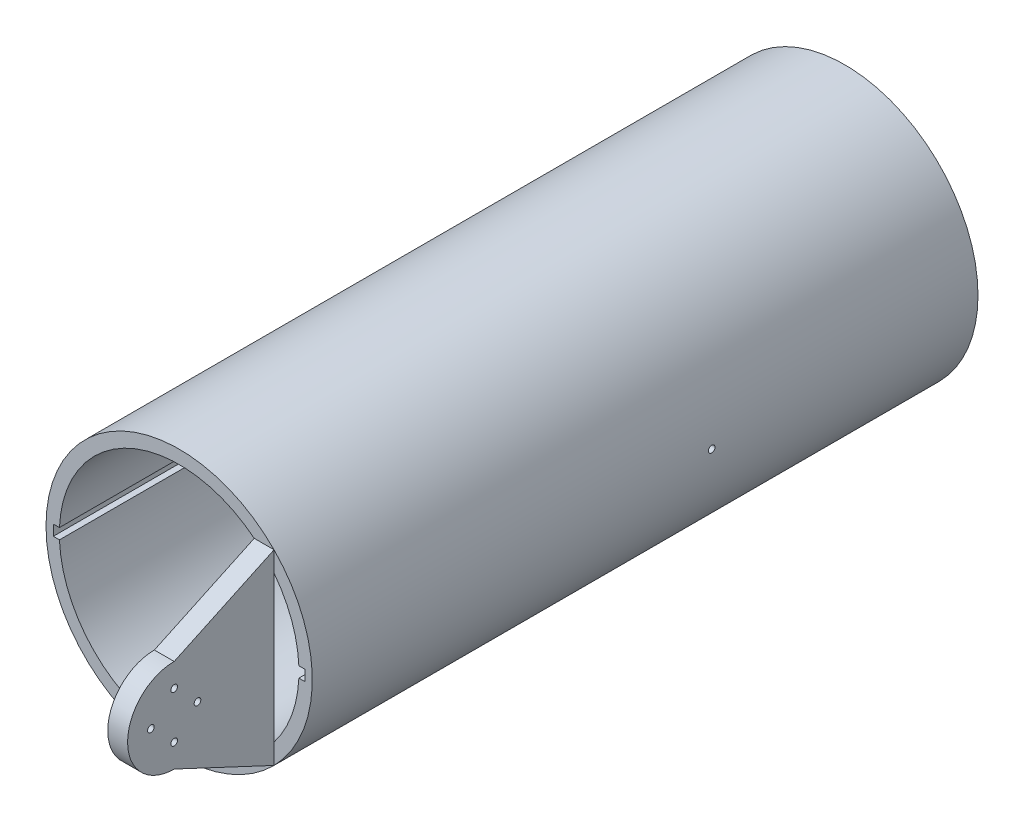
ISO-10303-21;
HEADER;
FILE_DESCRIPTION(('STEP AP214'),'2;1');
FILE_NAME('part.step','',(''),(''),'','','');
FILE_SCHEMA(('AUTOMOTIVE_DESIGN { 1 0 10303 214 1 1 1 1 }'));
ENDSEC;
DATA;
#1=APPLICATION_CONTEXT('core data for automotive mechanical design processes');
#2=APPLICATION_PROTOCOL_DEFINITION('international standard','automotive_design',2000,#1);
#3=PRODUCT_CONTEXT('',#1,'mechanical');
#4=PRODUCT('Part','Part','',(#3));
#5=PRODUCT_RELATED_PRODUCT_CATEGORY('part','',(#4));
#6=PRODUCT_DEFINITION_FORMATION('','',#4);
#7=PRODUCT_DEFINITION_CONTEXT('part definition',#1,'design');
#8=PRODUCT_DEFINITION('design','',#6,#7);
#9=PRODUCT_DEFINITION_SHAPE('','',#8);
#10=(LENGTH_UNIT() NAMED_UNIT(*) SI_UNIT(.MILLI.,.METRE.));
#11=(NAMED_UNIT(*) PLANE_ANGLE_UNIT() SI_UNIT($,.RADIAN.));
#12=(NAMED_UNIT(*) SI_UNIT($,.STERADIAN.) SOLID_ANGLE_UNIT());
#13=UNCERTAINTY_MEASURE_WITH_UNIT(LENGTH_MEASURE(1.E-05),#10,'distance_accuracy_value','');
#14=(GEOMETRIC_REPRESENTATION_CONTEXT(3) GLOBAL_UNCERTAINTY_ASSIGNED_CONTEXT((#13)) GLOBAL_UNIT_ASSIGNED_CONTEXT((#10,
#11,#12)) REPRESENTATION_CONTEXT('',''));
#15=CARTESIAN_POINT('',(0.,0.,0.));
#16=DIRECTION('',(0.,0.,1.));
#17=DIRECTION('',(1.,0.,0.));
#18=AXIS2_PLACEMENT_3D('',#15,#16,#17);
#19=CARTESIAN_POINT('',(0.,0.,250.));
#20=DIRECTION('',(0.,0.,-1.));
#21=DIRECTION('',(-1.,0.,0.));
#22=AXIS2_PLACEMENT_3D('',#19,#20,#21);
#23=CYLINDRICAL_SURFACE('',#22,50.);
#24=CARTESIAN_POINT('',(50.,0.,101.25));
#25=CARTESIAN_POINT('',(49.9999997892433,-0.0702012806053509,101.249996890468));
#26=CARTESIAN_POINT('',(49.9998505669129,-0.140453184521729,101.244066287815));
#27=CARTESIAN_POINT('',(49.9992696347054,-0.279021411192673,101.220490687249));
#28=CARTESIAN_POINT('',(49.9988375866143,-0.347335314234984,101.202831663669));
#29=CARTESIAN_POINT('',(49.9977399359377,-0.480000032970664,101.156302971443));
#30=CARTESIAN_POINT('',(49.9970744467966,-0.544352755839818,101.127438747421));
#31=CARTESIAN_POINT('',(49.9955849996606,-0.66728119145738,101.059326712717));
#32=CARTESIAN_POINT('',(49.9947610805834,-0.725858317628449,101.020081451217));
#33=CARTESIAN_POINT('',(49.9930472282989,-0.835612011829375,100.932304373999));
#34=CARTESIAN_POINT('',(49.9921572753778,-0.886786356266493,100.883769778147));
#35=CARTESIAN_POINT('',(49.9904118342181,-0.980263255157657,100.778796235128));
#36=CARTESIAN_POINT('',(49.9895563473475,-1.02256545779515,100.722356974657));
#37=CARTESIAN_POINT('',(49.9879762331022,-1.09709940400727,100.603169665472));
#38=CARTESIAN_POINT('',(49.9872516204449,-1.12933001528882,100.540420908464));
#39=CARTESIAN_POINT('',(49.9860151168566,-1.1827984149725,100.410400905536));
#40=CARTESIAN_POINT('',(49.9855032252025,-1.20403624074213,100.343129674991));
#41=CARTESIAN_POINT('',(49.9847500083149,-1.23491198038136,100.205989232804));
#42=CARTESIAN_POINT('',(49.9845086262981,-1.24455232873584,100.136120569578));
#43=CARTESIAN_POINT('',(49.9843234739843,-1.25196695086035,99.9957562161149));
#44=CARTESIAN_POINT('',(49.9843797026986,-1.24974126405586,99.925260527962));
#45=CARTESIAN_POINT('',(49.9847833781213,-1.23348907585994,99.7856597612978));
#46=CARTESIAN_POINT('',(49.9851307597476,-1.21946521174131,99.7165543755436));
#47=CARTESIAN_POINT('',(49.9860774771185,-1.18001883030617,99.5816790450587));
#48=CARTESIAN_POINT('',(49.9866768133296,-1.15459629188151,99.5159091065049));
#49=CARTESIAN_POINT('',(49.9880599499198,-1.09307119196166,99.3895631952896));
#50=CARTESIAN_POINT('',(49.988843771187,-1.0569674209775,99.3289878118357));
#51=CARTESIAN_POINT('',(49.9905074926856,-0.975105623991352,99.21475701138));
#52=CARTESIAN_POINT('',(49.9913873930577,-0.929347583862107,99.1611016045044));
#53=CARTESIAN_POINT('',(49.9931443684604,-0.829461225210461,99.0622184655441));
#54=CARTESIAN_POINT('',(49.9940214426512,-0.775330617915762,99.0169930454051));
#55=CARTESIAN_POINT('',(49.9956736570713,-0.660243785237119,98.9362714726598));
#56=CARTESIAN_POINT('',(49.9964487972851,-0.599287558820383,98.9007753215255));
#57=CARTESIAN_POINT('',(49.9978097681651,-0.472278559451485,98.8405201705382));
#58=CARTESIAN_POINT('',(49.9983955975763,-0.406225752717142,98.8157612418629));
#59=CARTESIAN_POINT('',(49.9993118852416,-0.270899185047347,98.7776848280001));
#60=CARTESIAN_POINT('',(49.9996423439818,-0.201625430244547,98.7643673210292));
#61=CARTESIAN_POINT('',(50.0000105760241,-0.0618435041436848,98.7495546188588));
#62=CARTESIAN_POINT('',(50.0000484285156,0.00866432799248807,98.7480562249943));
#63=CARTESIAN_POINT('',(49.999827390649,0.148930569407979,98.7569159498476));
#64=CARTESIAN_POINT('',(49.9995685005257,0.218688979279795,98.7672740591908));
#65=CARTESIAN_POINT('',(49.9987832089567,0.355467259085124,98.7995501119755));
#66=CARTESIAN_POINT('',(49.9982568410845,0.422487471571989,98.8214666046421));
#67=CARTESIAN_POINT('',(49.9969959169746,0.551897387208432,98.876235815335));
#68=CARTESIAN_POINT('',(49.9962613604543,0.614287084075191,98.9090885481995));
#69=CARTESIAN_POINT('',(49.9946666309293,0.732679665489656,98.9848059046364));
#70=CARTESIAN_POINT('',(49.9938064309167,0.788681172235662,99.0276726819793));
#71=CARTESIAN_POINT('',(49.9920574600653,0.892693853571702,99.1221981272366));
#72=CARTESIAN_POINT('',(49.9911686891723,0.940705013006051,99.1738568118267));
#73=CARTESIAN_POINT('',(49.9894625477771,1.02738478773992,99.2845133569773));
#74=CARTESIAN_POINT('',(49.9886451930737,1.06605133914107,99.3435128345125));
#75=CARTESIAN_POINT('',(49.9871742851885,1.13293016503026,99.467167887786));
#76=CARTESIAN_POINT('',(49.9865207316976,1.16114245925612,99.5318234528452));
#77=CARTESIAN_POINT('',(49.9854512245261,1.20630831809067,99.6649475530868));
#78=CARTESIAN_POINT('',(49.9850352425774,1.22326322223585,99.7334156335601));
#79=CARTESIAN_POINT('',(49.9844876991685,1.24543740915402,99.8722276845196));
#80=CARTESIAN_POINT('',(49.9843561376915,1.25065669262368,99.9425716548945));
#81=CARTESIAN_POINT('',(49.9843922787728,1.24921131303956,100.08311792715));
#82=CARTESIAN_POINT('',(49.9845598992096,1.242549911081,100.153320262613));
#83=CARTESIAN_POINT('',(49.985175335134,1.21753894538223,100.291609864828));
#84=CARTESIAN_POINT('',(49.98562315118,1.19918935835732,100.359697127367));
#85=CARTESIAN_POINT('',(49.986748485414,1.15132321438058,100.49182541808));
#86=CARTESIAN_POINT('',(49.9874260076321,1.12180646151248,100.555866375244));
#87=CARTESIAN_POINT('',(49.9889343430816,1.05244537142006,100.678082151641));
#88=CARTESIAN_POINT('',(49.9897651506242,1.01260141744787,100.736257188454));
#89=CARTESIAN_POINT('',(49.9914866049636,0.92370883247783,100.845103812792));
#90=CARTESIAN_POINT('',(49.992377261793,0.874658655736825,100.895774137701));
#91=CARTESIAN_POINT('',(49.994118137793,0.768733478143212,100.988174453478));
#92=CARTESIAN_POINT('',(49.9949683468844,0.711856540554558,101.02990222495));
#93=CARTESIAN_POINT('',(49.9965327264857,0.591873911934435,101.103237927888));
#94=CARTESIAN_POINT('',(49.9972468156398,0.528764529907139,101.134839814985));
#95=CARTESIAN_POINT('',(49.998456932991,0.398183073403346,101.186962967462));
#96=CARTESIAN_POINT('',(49.9989532215103,0.330716318304683,101.207497467673));
#97=CARTESIAN_POINT('',(49.999538941339,0.219018516921423,101.231451616862));
#98=CARTESIAN_POINT('',(49.9997110897919,0.175512722018037,101.238398530281));
#99=CARTESIAN_POINT('',(49.9999416851822,0.0880112516517628,101.247673696205));
#100=CARTESIAN_POINT('',(50.0000001321426,0.0440155762883697,101.250001949649));
#101=CARTESIAN_POINT('',(50.,0.,101.25));
#102=B_SPLINE_CURVE_WITH_KNOTS('',3,(#24,#25,#26,#27,#28,#29,#30,#31,#32,#33,#34,#35,#36,#37,
#38,#39,#40,#41,#42,#43,#44,#45,#46,#47,#48,#49,#50,#51,#52,#53,#54,#55,#56,#57,#58,#59,#60,#61,
#62,#63,#64,#65,#66,#67,#68,#69,#70,#71,#72,#73,#74,#75,#76,#77,#78,#79,#80,#81,#82,#83,#84,#85,
#86,#87,#88,#89,#90,#91,#92,#93,#94,#95,#96,#97,#98,#99,#100,#101),.UNSPECIFIED.,.T.,.F.,(4,2,2,
2,2,2,2,2,2,2,2,2,2,2,2,2,2,2,2,2,2,2,2,2,2,2,2,2,2,2,2,2,2,2,2,2,2,2,4),(0.,0.210443181033347,
0.421138479019948,0.631731527740004,0.842272910862806,1.05287740411288,1.26349024711038,
1.47412675962819,1.68476255612964,1.89535412929105,2.10594500275222,2.31648881487096,
2.52703301687766,2.73760106897999,2.94816942921227,3.15879545366897,3.36942150999579,
3.58004896255672,3.79067601410156,4.00124606064959,4.21181594070732,4.42235939693014,
4.63290313881923,4.84349220516216,5.05408167093516,5.26471760616385,5.47535314370606,
5.68596361286427,5.89657406951998,6.10712672521302,6.3176798003613,6.5282365696147,
6.73878552602708,6.94936986570474,7.16000640860575,7.37076845199211,7.58127789517965,
7.71322391796614,7.84516991395463),.UNSPECIFIED.);
#103=CARTESIAN_POINT('',(50.,0.,101.25));
#104=VERTEX_POINT('',#103);
#105=EDGE_CURVE('E223',#104,#104,#102,.T.);
#106=ORIENTED_EDGE('',*,*,#105,.F.);
#107=EDGE_LOOP('',(#106));
#108=FACE_BOUND('',#107,.T.);
#109=CARTESIAN_POINT('',(0.,0.,250.));
#110=DIRECTION('',(0.,0.,1.));
#111=DIRECTION('',(1.,0.,0.));
#112=AXIS2_PLACEMENT_3D('',#109,#110,#111);
#113=CIRCLE('',#112,50.);
#114=CARTESIAN_POINT('',(35.6404264845415,35.0679340708858,250.));
#115=VERTEX_POINT('',#114);
#116=CARTESIAN_POINT('',(35.6404264845415,-35.0679340708858,250.));
#117=VERTEX_POINT('',#116);
#118=EDGE_CURVE('E134',#115,#117,#113,.T.);
#119=ORIENTED_EDGE('',*,*,#118,.F.);
#120=EDGE_CURVE('E144',#117,#115,#113,.T.);
#121=ORIENTED_EDGE('',*,*,#120,.F.);
#122=EDGE_LOOP('',(#119,#121));
#123=FACE_BOUND('',#122,.T.);
#124=CARTESIAN_POINT('',(0.,0.,0.));
#125=DIRECTION('',(0.,0.,1.));
#126=DIRECTION('',(1.,0.,0.));
#127=AXIS2_PLACEMENT_3D('',#124,#125,#126);
#128=CIRCLE('',#127,50.);
#129=CARTESIAN_POINT('',(50.,0.,0.));
#130=VERTEX_POINT('',#129);
#131=EDGE_CURVE('E176',#130,#130,#128,.T.);
#132=ORIENTED_EDGE('',*,*,#131,.T.);
#133=EDGE_LOOP('',(#132));
#134=FACE_BOUND('',#133,.T.);
#135=CARTESIAN_POINT('',(-50.,0.,101.25));
#136=CARTESIAN_POINT('',(-49.9999997892433,0.0702012806053509,101.249996890468));
#137=CARTESIAN_POINT('',(-49.9998505669129,0.140453184521729,101.244066287815));
#138=CARTESIAN_POINT('',(-49.9992696347054,0.279021411192673,101.220490687249));
#139=CARTESIAN_POINT('',(-49.9988375866143,0.347335314234984,101.202831663669));
#140=CARTESIAN_POINT('',(-49.9977399359377,0.480000032970664,101.156302971443));
#141=CARTESIAN_POINT('',(-49.9970744467966,0.544352755839818,101.127438747421));
#142=CARTESIAN_POINT('',(-49.9955849996606,0.66728119145738,101.059326712717));
#143=CARTESIAN_POINT('',(-49.9947610805834,0.725858317628449,101.020081451217));
#144=CARTESIAN_POINT('',(-49.9930472282989,0.835612011829375,100.932304373999));
#145=CARTESIAN_POINT('',(-49.9921572753778,0.886786356266493,100.883769778147));
#146=CARTESIAN_POINT('',(-49.9904118342181,0.980263255157657,100.778796235128));
#147=CARTESIAN_POINT('',(-49.9895563473475,1.02256545779515,100.722356974657));
#148=CARTESIAN_POINT('',(-49.9879762331022,1.09709940400727,100.603169665472));
#149=CARTESIAN_POINT('',(-49.9872516204449,1.12933001528882,100.540420908464));
#150=CARTESIAN_POINT('',(-49.9860151168566,1.1827984149725,100.410400905536));
#151=CARTESIAN_POINT('',(-49.9855032252025,1.20403624074213,100.343129674991));
#152=CARTESIAN_POINT('',(-49.9847500083149,1.23491198038136,100.205989232804));
#153=CARTESIAN_POINT('',(-49.9845086262981,1.24455232873584,100.136120569578));
#154=CARTESIAN_POINT('',(-49.9843234739843,1.25196695086035,99.9957562161149));
#155=CARTESIAN_POINT('',(-49.9843797026986,1.24974126405586,99.925260527962));
#156=CARTESIAN_POINT('',(-49.9847833781213,1.23348907585994,99.7856597612978));
#157=CARTESIAN_POINT('',(-49.9851307597476,1.21946521174131,99.7165543755436));
#158=CARTESIAN_POINT('',(-49.9860774771185,1.18001883030617,99.5816790450587));
#159=CARTESIAN_POINT('',(-49.9866768133296,1.15459629188151,99.5159091065049));
#160=CARTESIAN_POINT('',(-49.9880599499198,1.09307119196166,99.3895631952896));
#161=CARTESIAN_POINT('',(-49.988843771187,1.0569674209775,99.3289878118357));
#162=CARTESIAN_POINT('',(-49.9905074926856,0.975105623991352,99.21475701138));
#163=CARTESIAN_POINT('',(-49.9913873930577,0.929347583862107,99.1611016045044));
#164=CARTESIAN_POINT('',(-49.9931443684604,0.829461225210461,99.0622184655441));
#165=CARTESIAN_POINT('',(-49.9940214426512,0.775330617915762,99.0169930454051));
#166=CARTESIAN_POINT('',(-49.9956736570713,0.660243785237119,98.9362714726598));
#167=CARTESIAN_POINT('',(-49.9964487972851,0.599287558820383,98.9007753215255));
#168=CARTESIAN_POINT('',(-49.9978097681651,0.472278559451485,98.8405201705382));
#169=CARTESIAN_POINT('',(-49.9983955975763,0.406225752717142,98.8157612418629));
#170=CARTESIAN_POINT('',(-49.9993118852416,0.270899185047347,98.7776848280001));
#171=CARTESIAN_POINT('',(-49.9996423439818,0.201625430244547,98.7643673210292));
#172=CARTESIAN_POINT('',(-50.0000105760241,0.0618435041436848,98.7495546188588));
#173=CARTESIAN_POINT('',(-50.0000484285156,-0.00866432799248807,98.7480562249943));
#174=CARTESIAN_POINT('',(-49.999827390649,-0.148930569407979,98.7569159498476));
#175=CARTESIAN_POINT('',(-49.9995685005257,-0.218688979279795,98.7672740591908));
#176=CARTESIAN_POINT('',(-49.9987832089567,-0.355467259085124,98.7995501119755));
#177=CARTESIAN_POINT('',(-49.9982568410845,-0.422487471571989,98.8214666046421));
#178=CARTESIAN_POINT('',(-49.9969959169746,-0.551897387208432,98.876235815335));
#179=CARTESIAN_POINT('',(-49.9962613604543,-0.614287084075191,98.9090885481995));
#180=CARTESIAN_POINT('',(-49.9946666309293,-0.732679665489656,98.9848059046364));
#181=CARTESIAN_POINT('',(-49.9938064309167,-0.788681172235662,99.0276726819793));
#182=CARTESIAN_POINT('',(-49.9920574600653,-0.892693853571702,99.1221981272366));
#183=CARTESIAN_POINT('',(-49.9911686891723,-0.940705013006051,99.1738568118267));
#184=CARTESIAN_POINT('',(-49.9894625477771,-1.02738478773992,99.2845133569773));
#185=CARTESIAN_POINT('',(-49.9886451930737,-1.06605133914107,99.3435128345125));
#186=CARTESIAN_POINT('',(-49.9871742851885,-1.13293016503026,99.467167887786));
#187=CARTESIAN_POINT('',(-49.9865207316976,-1.16114245925612,99.5318234528452));
#188=CARTESIAN_POINT('',(-49.9854512245261,-1.20630831809067,99.6649475530868));
#189=CARTESIAN_POINT('',(-49.9850352425774,-1.22326322223585,99.7334156335601));
#190=CARTESIAN_POINT('',(-49.9844876991685,-1.24543740915402,99.8722276845196));
#191=CARTESIAN_POINT('',(-49.9843561376915,-1.25065669262368,99.9425716548945));
#192=CARTESIAN_POINT('',(-49.9843922787728,-1.24921131303956,100.08311792715));
#193=CARTESIAN_POINT('',(-49.9845598992096,-1.242549911081,100.153320262613));
#194=CARTESIAN_POINT('',(-49.985175335134,-1.21753894538223,100.291609864828));
#195=CARTESIAN_POINT('',(-49.98562315118,-1.19918935835732,100.359697127367));
#196=CARTESIAN_POINT('',(-49.986748485414,-1.15132321438058,100.49182541808));
#197=CARTESIAN_POINT('',(-49.9874260076321,-1.12180646151248,100.555866375244));
#198=CARTESIAN_POINT('',(-49.9889343430816,-1.05244537142006,100.678082151641));
#199=CARTESIAN_POINT('',(-49.9897651506242,-1.01260141744787,100.736257188454));
#200=CARTESIAN_POINT('',(-49.9914866049636,-0.92370883247783,100.845103812792));
#201=CARTESIAN_POINT('',(-49.992377261793,-0.874658655736825,100.895774137701));
#202=CARTESIAN_POINT('',(-49.994118137793,-0.768733478143212,100.988174453478));
#203=CARTESIAN_POINT('',(-49.9949683468844,-0.711856540554558,101.02990222495));
#204=CARTESIAN_POINT('',(-49.9965327264857,-0.591873911934435,101.103237927888));
#205=CARTESIAN_POINT('',(-49.9972468156398,-0.528764529907139,101.134839814985));
#206=CARTESIAN_POINT('',(-49.998456932991,-0.398183073403346,101.186962967462));
#207=CARTESIAN_POINT('',(-49.9989532215103,-0.330716318304683,101.207497467673));
#208=CARTESIAN_POINT('',(-49.999538941339,-0.219018516921423,101.231451616862));
#209=CARTESIAN_POINT('',(-49.9997110897919,-0.175512722018037,101.238398530281));
#210=CARTESIAN_POINT('',(-49.9999416851822,-0.0880112516517628,101.247673696205));
#211=CARTESIAN_POINT('',(-50.0000001321426,-0.0440155762883697,101.250001949649));
#212=CARTESIAN_POINT('',(-50.,0.,101.25));
#213=B_SPLINE_CURVE_WITH_KNOTS('',3,(#135,#136,#137,#138,#139,#140,#141,#142,#143,#144,#145,
#146,#147,#148,#149,#150,#151,#152,#153,#154,#155,#156,#157,#158,#159,#160,#161,#162,#163,#164,
#165,#166,#167,#168,#169,#170,#171,#172,#173,#174,#175,#176,#177,#178,#179,#180,#181,#182,#183,
#184,#185,#186,#187,#188,#189,#190,#191,#192,#193,#194,#195,#196,#197,#198,#199,#200,#201,#202,
#203,#204,#205,#206,#207,#208,#209,#210,#211,#212),.UNSPECIFIED.,.T.,.F.,(4,2,2,2,2,2,2,2,2,2,2,
2,2,2,2,2,2,2,2,2,2,2,2,2,2,2,2,2,2,2,2,2,2,2,2,2,2,2,4),(0.,0.210443181033347,
0.421138479019948,0.631731527740004,0.842272910862806,1.05287740411288,1.26349024711038,
1.47412675962819,1.68476255612964,1.89535412929105,2.10594500275222,2.31648881487096,
2.52703301687766,2.73760106897999,2.94816942921227,3.15879545366897,3.36942150999579,
3.58004896255672,3.79067601410156,4.00124606064959,4.21181594070732,4.42235939693014,
4.63290313881923,4.84349220516216,5.05408167093516,5.26471760616385,5.47535314370606,
5.68596361286427,5.89657406951998,6.10712672521302,6.3176798003613,6.5282365696147,
6.73878552602708,6.94936986570474,7.16000640860575,7.37076845199211,7.58127789517965,
7.71322391796614,7.84516991395463),.UNSPECIFIED.);
#214=CARTESIAN_POINT('',(-50.,0.,101.25));
#215=VERTEX_POINT('',#214);
#216=EDGE_CURVE('E154',#215,#215,#213,.T.);
#217=ORIENTED_EDGE('',*,*,#216,.F.);
#218=EDGE_LOOP('',(#217));
#219=FACE_BOUND('',#218,.T.);
#220=ADVANCED_FACE('F34',(#108,#123,#134,#219),#23,.T.);
#221=CARTESIAN_POINT('',(-47.2555555555556,1.99950611185813,250.));
#222=DIRECTION('',(1.,0.,0.));
#223=DIRECTION('',(0.,0.,-1.));
#224=AXIS2_PLACEMENT_3D('',#221,#222,#223);
#225=PLANE('',#224);
#226=DIRECTION('',(0.,-1.,0.));
#227=VECTOR('',#226,1.);
#228=CARTESIAN_POINT('',(-47.2555555555556,1.99950611185813,0.));
#229=LINE('',#228,#227);
#230=CARTESIAN_POINT('',(-47.2555555555556,1.99950611185813,0.));
#231=VERTEX_POINT('',#230);
#232=CARTESIAN_POINT('',(-47.2555555555556,-1.99950611185813,0.));
#233=VERTEX_POINT('',#232);
#234=EDGE_CURVE('E512',#231,#233,#229,.T.);
#235=ORIENTED_EDGE('',*,*,#234,.F.);
#236=DIRECTION('',(0.,0.,-1.));
#237=VECTOR('',#236,1.);
#238=CARTESIAN_POINT('',(-47.2555555555556,1.99950611185813,250.));
#239=LINE('',#238,#237);
#240=CARTESIAN_POINT('',(-47.2555555555556,1.99950611185813,250.));
#241=VERTEX_POINT('',#240);
#242=EDGE_CURVE('E540',#241,#231,#239,.T.);
#243=ORIENTED_EDGE('',*,*,#242,.F.);
#244=DIRECTION('',(0.,-1.,0.));
#245=VECTOR('',#244,1.);
#246=CARTESIAN_POINT('',(-47.2555555555556,1.99950611185813,250.));
#247=LINE('',#246,#245);
#248=CARTESIAN_POINT('',(-47.2555555555556,-1.99950611185813,250.));
#249=VERTEX_POINT('',#248);
#250=EDGE_CURVE('E496',#241,#249,#247,.T.);
#251=ORIENTED_EDGE('',*,*,#250,.T.);
#252=DIRECTION('',(0.,0.,-1.));
#253=VECTOR('',#252,1.);
#254=CARTESIAN_POINT('',(-47.2555555555556,-1.99950611185813,250.));
#255=LINE('',#254,#253);
#256=EDGE_CURVE('E539',#249,#233,#255,.T.);
#257=ORIENTED_EDGE('',*,*,#256,.T.);
#258=EDGE_LOOP('',(#235,#243,#251,#257));
#259=FACE_BOUND('',#258,.T.);
#260=CARTESIAN_POINT('',(-47.2555555555556,0.,100.));
#261=DIRECTION('',(1.,0.,0.));
#262=DIRECTION('',(0.,0.,-1.));
#263=AXIS2_PLACEMENT_3D('',#260,#261,#262);
#264=CIRCLE('',#263,1.25);
#265=CARTESIAN_POINT('',(-47.2555555555556,0.,98.75));
#266=VERTEX_POINT('',#265);
#267=EDGE_CURVE('E186',#266,#266,#264,.F.);
#268=ORIENTED_EDGE('',*,*,#267,.T.);
#269=EDGE_LOOP('',(#268));
#270=FACE_BOUND('',#269,.T.);
#271=ADVANCED_FACE('F260',(#259,#270),#225,.T.);
#272=CARTESIAN_POINT('',(47.2555555555554,1.99950611185836,250.));
#273=DIRECTION('',(-1.,0.,0.));
#274=DIRECTION('',(0.,-1.,0.));
#275=AXIS2_PLACEMENT_3D('',#272,#273,#274);
#276=PLANE('',#275);
#277=DIRECTION('',(0.,1.,0.));
#278=VECTOR('',#277,1.);
#279=CARTESIAN_POINT('',(47.2555555555554,1.99950611185836,0.));
#280=LINE('',#279,#278);
#281=CARTESIAN_POINT('',(47.2555555555555,-1.99950611185791,0.));
#282=VERTEX_POINT('',#281);
#283=CARTESIAN_POINT('',(47.2555555555554,1.99950611185836,0.));
#284=VERTEX_POINT('',#283);
#285=EDGE_CURVE('E524',#282,#284,#280,.T.);
#286=ORIENTED_EDGE('',*,*,#285,.F.);
#287=DIRECTION('',(0.,0.,-1.));
#288=VECTOR('',#287,1.);
#289=CARTESIAN_POINT('',(47.2555555555555,-1.99950611185791,250.));
#290=LINE('',#289,#288);
#291=CARTESIAN_POINT('',(47.2555555555555,-1.99950611185791,250.));
#292=VERTEX_POINT('',#291);
#293=EDGE_CURVE('E533',#292,#282,#290,.T.);
#294=ORIENTED_EDGE('',*,*,#293,.F.);
#295=DIRECTION('',(0.,1.,0.));
#296=VECTOR('',#295,1.);
#297=CARTESIAN_POINT('',(47.2555555555554,1.99950611185836,250.));
#298=LINE('',#297,#296);
#299=CARTESIAN_POINT('',(47.2555555555554,1.99950611185836,250.));
#300=VERTEX_POINT('',#299);
#301=EDGE_CURVE('E505',#292,#300,#298,.T.);
#302=ORIENTED_EDGE('',*,*,#301,.T.);
#303=DIRECTION('',(0.,0.,-1.));
#304=VECTOR('',#303,1.);
#305=CARTESIAN_POINT('',(47.2555555555554,1.99950611185836,250.));
#306=LINE('',#305,#304);
#307=EDGE_CURVE('E59',#300,#284,#306,.T.);
#308=ORIENTED_EDGE('',*,*,#307,.T.);
#309=EDGE_LOOP('',(#286,#294,#302,#308));
#310=FACE_BOUND('',#309,.T.);
#311=CARTESIAN_POINT('',(47.2555555555555,0.,100.));
#312=DIRECTION('',(-1.,0.,0.));
#313=DIRECTION('',(0.,-1.,0.));
#314=AXIS2_PLACEMENT_3D('',#311,#312,#313);
#315=CIRCLE('',#314,1.25);
#316=CARTESIAN_POINT('',(47.2555555555555,-1.25,100.));
#317=VERTEX_POINT('',#316);
#318=EDGE_CURVE('E183',#317,#317,#315,.F.);
#319=ORIENTED_EDGE('',*,*,#318,.T.);
#320=EDGE_LOOP('',(#319));
#321=FACE_BOUND('',#320,.T.);
#322=ADVANCED_FACE('F257',(#310,#321),#276,.T.);
#323=CARTESIAN_POINT('',(0.,0.,250.));
#324=DIRECTION('',(0.,0.,1.));
#325=DIRECTION('',(1.,0.,0.));
#326=AXIS2_PLACEMENT_3D('',#323,#324,#325);
#327=PLANE('',#326);
#328=DIRECTION('',(1.,0.,0.));
#329=VECTOR('',#328,1.);
#330=CARTESIAN_POINT('',(35.6404264845415,-35.0679340708858,250.));
#331=LINE('',#330,#329);
#332=CARTESIAN_POINT('',(28.2,-35.0679340708858,250.));
#333=VERTEX_POINT('',#332);
#334=EDGE_CURVE('E138',#333,#117,#331,.T.);
#335=ORIENTED_EDGE('',*,*,#334,.F.);
#336=CARTESIAN_POINT('',(0.,0.,250.));
#337=DIRECTION('',(0.,0.,1.));
#338=DIRECTION('',(1.,0.,0.));
#339=AXIS2_PLACEMENT_3D('',#336,#337,#338);
#340=CIRCLE('',#339,45.);
#341=CARTESIAN_POINT('',(-44.9555555555556,-1.99950611185813,250.));
#342=VERTEX_POINT('',#341);
#343=EDGE_CURVE('E500',#342,#333,#340,.T.);
#344=ORIENTED_EDGE('',*,*,#343,.F.);
#345=DIRECTION('',(1.,0.,0.));
#346=VECTOR('',#345,1.);
#347=CARTESIAN_POINT('',(-44.9555555555556,-1.99950611185813,250.));
#348=LINE('',#347,#346);
#349=EDGE_CURVE('E498',#249,#342,#348,.T.);
#350=ORIENTED_EDGE('',*,*,#349,.F.);
#351=ORIENTED_EDGE('',*,*,#250,.F.);
#352=DIRECTION('',(-1.,0.,0.));
#353=VECTOR('',#352,1.);
#354=CARTESIAN_POINT('',(-44.9555555555556,1.99950611185813,250.));
#355=LINE('',#354,#353);
#356=CARTESIAN_POINT('',(-44.9555555555556,1.99950611185813,250.));
#357=VERTEX_POINT('',#356);
#358=EDGE_CURVE('E492',#357,#241,#355,.T.);
#359=ORIENTED_EDGE('',*,*,#358,.F.);
#360=CARTESIAN_POINT('',(0.,0.,250.));
#361=DIRECTION('',(0.,0.,1.));
#362=DIRECTION('',(1.,0.,0.));
#363=AXIS2_PLACEMENT_3D('',#360,#361,#362);
#364=CIRCLE('',#363,45.);
#365=CARTESIAN_POINT('',(28.2,35.0679340708858,250.));
#366=VERTEX_POINT('',#365);
#367=EDGE_CURVE('E494',#366,#357,#364,.T.);
#368=ORIENTED_EDGE('',*,*,#367,.F.);
#369=DIRECTION('',(-1.,0.,0.));
#370=VECTOR('',#369,1.);
#371=CARTESIAN_POINT('',(28.2,35.0679340708858,250.));
#372=LINE('',#371,#370);
#373=EDGE_CURVE('E141',#115,#366,#372,.T.);
#374=ORIENTED_EDGE('',*,*,#373,.F.);
#375=ORIENTED_EDGE('',*,*,#118,.T.);
#376=EDGE_LOOP('',(#335,#344,#350,#351,#359,#368,#374,#375));
#377=FACE_BOUND('',#376,.T.);
#378=ADVANCED_FACE('F136',(#377),#327,.T.);
#379=DIRECTION('',(0.,1.,0.));
#380=VECTOR('',#379,1.);
#381=CARTESIAN_POINT('',(35.6404264845415,35.0679340708858,250.));
#382=LINE('',#381,#380);
#383=CARTESIAN_POINT('',(35.6404264845415,-27.4728957337954,250.));
#384=VERTEX_POINT('',#383);
#385=EDGE_CURVE('E161',#117,#384,#382,.T.);
#386=ORIENTED_EDGE('',*,*,#385,.F.);
#387=ORIENTED_EDGE('',*,*,#120,.T.);
#388=CARTESIAN_POINT('',(35.6404264845415,27.4728957337954,250.));
#389=VERTEX_POINT('',#388);
#390=EDGE_CURVE('E51',#389,#115,#382,.T.);
#391=ORIENTED_EDGE('',*,*,#390,.F.);
#392=CARTESIAN_POINT('',(44.9555555555554,1.99950611185834,250.));
#393=VERTEX_POINT('',#392);
#394=EDGE_CURVE('E490',#393,#389,#364,.T.);
#395=ORIENTED_EDGE('',*,*,#394,.F.);
#396=DIRECTION('',(-1.,0.,0.));
#397=VECTOR('',#396,1.);
#398=CARTESIAN_POINT('',(44.9555555555554,1.99950611185834,250.));
#399=LINE('',#398,#397);
#400=EDGE_CURVE('E507',#300,#393,#399,.T.);
#401=ORIENTED_EDGE('',*,*,#400,.F.);
#402=ORIENTED_EDGE('',*,*,#301,.F.);
#403=DIRECTION('',(1.,0.,0.));
#404=VECTOR('',#403,1.);
#405=CARTESIAN_POINT('',(44.9555555555555,-1.99950611185793,250.));
#406=LINE('',#405,#404);
#407=CARTESIAN_POINT('',(44.9555555555555,-1.99950611185793,250.));
#408=VERTEX_POINT('',#407);
#409=EDGE_CURVE('E502',#408,#292,#406,.T.);
#410=ORIENTED_EDGE('',*,*,#409,.F.);
#411=EDGE_CURVE('E172',#384,#408,#340,.T.);
#412=ORIENTED_EDGE('',*,*,#411,.F.);
#413=EDGE_LOOP('',(#386,#387,#391,#395,#401,#402,#410,#412));
#414=FACE_BOUND('',#413,.T.);
#415=ADVANCED_FACE('F170',(#414),#327,.T.);
#416=CARTESIAN_POINT('',(0.,0.,0.));
#417=DIRECTION('',(0.,0.,1.));
#418=DIRECTION('',(1.,0.,0.));
#419=AXIS2_PLACEMENT_3D('',#416,#417,#418);
#420=PLANE('',#419);
#421=ORIENTED_EDGE('',*,*,#131,.F.);
#422=EDGE_LOOP('',(#421));
#423=FACE_BOUND('',#422,.T.);
#424=CARTESIAN_POINT('',(0.,0.,0.));
#425=DIRECTION('',(0.,0.,1.));
#426=DIRECTION('',(1.,0.,0.));
#427=AXIS2_PLACEMENT_3D('',#424,#425,#426);
#428=CIRCLE('',#427,45.);
#429=CARTESIAN_POINT('',(44.9555555555554,1.99950611185834,0.));
#430=VERTEX_POINT('',#429);
#431=CARTESIAN_POINT('',(-44.9555555555556,1.99950611185813,0.));
#432=VERTEX_POINT('',#431);
#433=EDGE_CURVE('E483',#430,#432,#428,.T.);
#434=ORIENTED_EDGE('',*,*,#433,.T.);
#435=DIRECTION('',(-1.,0.,0.));
#436=VECTOR('',#435,1.);
#437=CARTESIAN_POINT('',(-44.9555555555556,1.99950611185813,0.));
#438=LINE('',#437,#436);
#439=EDGE_CURVE('E486',#432,#231,#438,.T.);
#440=ORIENTED_EDGE('',*,*,#439,.T.);
#441=ORIENTED_EDGE('',*,*,#234,.T.);
#442=DIRECTION('',(1.,0.,0.));
#443=VECTOR('',#442,1.);
#444=CARTESIAN_POINT('',(-44.9555555555556,-1.99950611185813,0.));
#445=LINE('',#444,#443);
#446=CARTESIAN_POINT('',(-44.9555555555556,-1.99950611185813,0.));
#447=VERTEX_POINT('',#446);
#448=EDGE_CURVE('E515',#233,#447,#445,.T.);
#449=ORIENTED_EDGE('',*,*,#448,.T.);
#450=CARTESIAN_POINT('',(0.,0.,0.));
#451=DIRECTION('',(0.,0.,1.));
#452=DIRECTION('',(1.,0.,0.));
#453=AXIS2_PLACEMENT_3D('',#450,#451,#452);
#454=CIRCLE('',#453,45.);
#455=CARTESIAN_POINT('',(44.9555555555555,-1.99950611185793,0.));
#456=VERTEX_POINT('',#455);
#457=EDGE_CURVE('E518',#447,#456,#454,.T.);
#458=ORIENTED_EDGE('',*,*,#457,.T.);
#459=DIRECTION('',(1.,0.,0.));
#460=VECTOR('',#459,1.);
#461=CARTESIAN_POINT('',(44.9555555555555,-1.99950611185793,0.));
#462=LINE('',#461,#460);
#463=EDGE_CURVE('E521',#456,#282,#462,.T.);
#464=ORIENTED_EDGE('',*,*,#463,.T.);
#465=ORIENTED_EDGE('',*,*,#285,.T.);
#466=DIRECTION('',(-1.,0.,0.));
#467=VECTOR('',#466,1.);
#468=CARTESIAN_POINT('',(44.9555555555554,1.99950611185834,0.));
#469=LINE('',#468,#467);
#470=EDGE_CURVE('E527',#284,#430,#469,.T.);
#471=ORIENTED_EDGE('',*,*,#470,.T.);
#472=EDGE_LOOP('',(#434,#440,#441,#449,#458,#464,#465,#471));
#473=FACE_BOUND('',#472,.T.);
#474=ADVANCED_FACE('F283',(#423,#473),#420,.F.);
#475=CARTESIAN_POINT('',(0.,0.,250.));
#476=DIRECTION('',(0.,0.,-1.));
#477=DIRECTION('',(-1.,0.,0.));
#478=AXIS2_PLACEMENT_3D('',#475,#476,#477);
#479=CYLINDRICAL_SURFACE('',#478,45.);
#480=ORIENTED_EDGE('',*,*,#433,.F.);
#481=DIRECTION('',(0.,0.,-1.));
#482=VECTOR('',#481,1.);
#483=CARTESIAN_POINT('',(44.9555555555554,1.99950611185834,250.));
#484=LINE('',#483,#482);
#485=EDGE_CURVE('E508',#393,#430,#484,.T.);
#486=ORIENTED_EDGE('',*,*,#485,.F.);
#487=ORIENTED_EDGE('',*,*,#394,.T.);
#488=EDGE_CURVE('E493',#389,#366,#364,.T.);
#489=ORIENTED_EDGE('',*,*,#488,.T.);
#490=ORIENTED_EDGE('',*,*,#367,.T.);
#491=DIRECTION('',(0.,0.,-1.));
#492=VECTOR('',#491,1.);
#493=CARTESIAN_POINT('',(-44.9555555555556,1.99950611185813,250.));
#494=LINE('',#493,#492);
#495=EDGE_CURVE('E178',#357,#432,#494,.T.);
#496=ORIENTED_EDGE('',*,*,#495,.T.);
#497=EDGE_LOOP('',(#480,#486,#487,#489,#490,#496));
#498=FACE_BOUND('',#497,.T.);
#499=ADVANCED_FACE('F279',(#498),#479,.F.);
#500=CARTESIAN_POINT('',(-44.9555555555556,1.99950611185813,250.));
#501=DIRECTION('',(0.,-1.,0.));
#502=DIRECTION('',(0.,0.,-1.));
#503=AXIS2_PLACEMENT_3D('',#500,#501,#502);
#504=PLANE('',#503);
#505=ORIENTED_EDGE('',*,*,#439,.F.);
#506=ORIENTED_EDGE('',*,*,#495,.F.);
#507=ORIENTED_EDGE('',*,*,#358,.T.);
#508=ORIENTED_EDGE('',*,*,#242,.T.);
#509=EDGE_LOOP('',(#505,#506,#507,#508));
#510=FACE_BOUND('',#509,.T.);
#511=ADVANCED_FACE('F272',(#510),#504,.T.);
#512=CARTESIAN_POINT('',(-44.9555555555556,-1.99950611185813,250.));
#513=DIRECTION('',(0.,1.,0.));
#514=DIRECTION('',(0.,0.,1.));
#515=AXIS2_PLACEMENT_3D('',#512,#513,#514);
#516=PLANE('',#515);
#517=ORIENTED_EDGE('',*,*,#448,.F.);
#518=ORIENTED_EDGE('',*,*,#256,.F.);
#519=ORIENTED_EDGE('',*,*,#349,.T.);
#520=DIRECTION('',(0.,0.,-1.));
#521=VECTOR('',#520,1.);
#522=CARTESIAN_POINT('',(-44.9555555555556,-1.99950611185813,250.));
#523=LINE('',#522,#521);
#524=EDGE_CURVE('E537',#342,#447,#523,.T.);
#525=ORIENTED_EDGE('',*,*,#524,.T.);
#526=EDGE_LOOP('',(#517,#518,#519,#525));
#527=FACE_BOUND('',#526,.T.);
#528=ADVANCED_FACE('F268',(#527),#516,.T.);
#529=CARTESIAN_POINT('',(0.,0.,250.));
#530=DIRECTION('',(0.,0.,-1.));
#531=DIRECTION('',(-1.,0.,0.));
#532=AXIS2_PLACEMENT_3D('',#529,#530,#531);
#533=CYLINDRICAL_SURFACE('',#532,45.);
#534=ORIENTED_EDGE('',*,*,#457,.F.);
#535=ORIENTED_EDGE('',*,*,#524,.F.);
#536=ORIENTED_EDGE('',*,*,#343,.T.);
#537=EDGE_CURVE('E503',#333,#384,#340,.T.);
#538=ORIENTED_EDGE('',*,*,#537,.T.);
#539=ORIENTED_EDGE('',*,*,#411,.T.);
#540=DIRECTION('',(0.,0.,-1.));
#541=VECTOR('',#540,1.);
#542=CARTESIAN_POINT('',(44.9555555555555,-1.99950611185793,250.));
#543=LINE('',#542,#541);
#544=EDGE_CURVE('E535',#408,#456,#543,.T.);
#545=ORIENTED_EDGE('',*,*,#544,.T.);
#546=EDGE_LOOP('',(#534,#535,#536,#538,#539,#545));
#547=FACE_BOUND('',#546,.T.);
#548=ADVANCED_FACE('F264',(#547),#533,.F.);
#549=CARTESIAN_POINT('',(44.9555555555555,-1.99950611185793,250.));
#550=DIRECTION('',(0.,1.,0.));
#551=DIRECTION('',(-1.,0.,0.));
#552=AXIS2_PLACEMENT_3D('',#549,#550,#551);
#553=PLANE('',#552);
#554=ORIENTED_EDGE('',*,*,#463,.F.);
#555=ORIENTED_EDGE('',*,*,#544,.F.);
#556=ORIENTED_EDGE('',*,*,#409,.T.);
#557=ORIENTED_EDGE('',*,*,#293,.T.);
#558=EDGE_LOOP('',(#554,#555,#556,#557));
#559=FACE_BOUND('',#558,.T.);
#560=ADVANCED_FACE('F256',(#559),#553,.T.);
#561=CARTESIAN_POINT('',(44.9555555555554,1.99950611185834,250.));
#562=DIRECTION('',(0.,-1.,0.));
#563=DIRECTION('',(1.,0.,0.));
#564=AXIS2_PLACEMENT_3D('',#561,#562,#563);
#565=PLANE('',#564);
#566=ORIENTED_EDGE('',*,*,#470,.F.);
#567=ORIENTED_EDGE('',*,*,#307,.F.);
#568=ORIENTED_EDGE('',*,*,#400,.T.);
#569=ORIENTED_EDGE('',*,*,#485,.T.);
#570=EDGE_LOOP('',(#566,#567,#568,#569));
#571=FACE_BOUND('',#570,.T.);
#572=ADVANCED_FACE('F245',(#571),#565,.T.);
#573=CARTESIAN_POINT('',(0.,0.,250.));
#574=DIRECTION('',(0.,0.,-1.));
#575=DIRECTION('',(-1.,0.,0.));
#576=AXIS2_PLACEMENT_3D('',#573,#574,#575);
#577=PLANE('',#576);
#578=ORIENTED_EDGE('',*,*,#488,.F.);
#579=EDGE_CURVE('E153',#384,#389,#382,.T.);
#580=ORIENTED_EDGE('',*,*,#579,.F.);
#581=ORIENTED_EDGE('',*,*,#537,.F.);
#582=DIRECTION('',(0.,-1.,0.));
#583=VECTOR('',#582,1.);
#584=CARTESIAN_POINT('',(28.2,0.,250.));
#585=LINE('',#584,#583);
#586=EDGE_CURVE('E481',#366,#333,#585,.T.);
#587=ORIENTED_EDGE('',*,*,#586,.F.);
#588=EDGE_LOOP('',(#578,#580,#581,#587));
#589=FACE_BOUND('',#588,.T.);
#590=ADVANCED_FACE('F241',(#589),#577,.T.);
#591=CARTESIAN_POINT('',(35.6404264845415,35.0679340708858,305.));
#592=DIRECTION('',(-1.,0.,0.));
#593=DIRECTION('',(0.,0.,1.));
#594=AXIS2_PLACEMENT_3D('',#591,#592,#593);
#595=PLANE('',#594);
#596=CARTESIAN_POINT('',(35.6404264845415,-8.75,287.5));
#597=DIRECTION('',(1.,0.,0.));
#598=DIRECTION('',(0.,0.,-1.));
#599=AXIS2_PLACEMENT_3D('',#596,#597,#598);
#600=CIRCLE('',#599,1.25000000000001);
#601=CARTESIAN_POINT('',(35.6404264845415,-8.75,286.25));
#602=VERTEX_POINT('',#601);
#603=EDGE_CURVE('E208',#602,#602,#600,.T.);
#604=ORIENTED_EDGE('',*,*,#603,.F.);
#605=EDGE_LOOP('',(#604));
#606=FACE_BOUND('',#605,.T.);
#607=CARTESIAN_POINT('',(35.6404264845415,0.,278.75));
#608=DIRECTION('',(1.,0.,0.));
#609=DIRECTION('',(0.,0.,-1.));
#610=AXIS2_PLACEMENT_3D('',#607,#608,#609);
#611=CIRCLE('',#610,1.25000000000001);
#612=CARTESIAN_POINT('',(35.6404264845415,0.,277.5));
#613=VERTEX_POINT('',#612);
#614=EDGE_CURVE('E198',#613,#613,#611,.T.);
#615=ORIENTED_EDGE('',*,*,#614,.F.);
#616=EDGE_LOOP('',(#615));
#617=FACE_BOUND('',#616,.T.);
#618=CARTESIAN_POINT('',(35.6404264845415,8.75,287.5));
#619=DIRECTION('',(1.,0.,0.));
#620=DIRECTION('',(0.,0.,-1.));
#621=AXIS2_PLACEMENT_3D('',#618,#619,#620);
#622=CIRCLE('',#621,1.25000000000001);
#623=CARTESIAN_POINT('',(35.6404264845415,8.75,286.25));
#624=VERTEX_POINT('',#623);
#625=EDGE_CURVE('E195',#624,#624,#622,.T.);
#626=ORIENTED_EDGE('',*,*,#625,.F.);
#627=EDGE_LOOP('',(#626));
#628=FACE_BOUND('',#627,.T.);
#629=CARTESIAN_POINT('',(35.6404264845415,0.,296.25));
#630=DIRECTION('',(1.,0.,0.));
#631=DIRECTION('',(0.,0.,-1.));
#632=AXIS2_PLACEMENT_3D('',#629,#630,#631);
#633=CIRCLE('',#632,1.25000000000001);
#634=CARTESIAN_POINT('',(35.6404264845415,0.,295.));
#635=VERTEX_POINT('',#634);
#636=EDGE_CURVE('E192',#635,#635,#633,.T.);
#637=ORIENTED_EDGE('',*,*,#636,.F.);
#638=EDGE_LOOP('',(#637));
#639=FACE_BOUND('',#638,.T.);
#640=CARTESIAN_POINT('',(35.6404264845415,0.,287.5));
#641=DIRECTION('',(-1.,0.,0.));
#642=DIRECTION('',(0.,0.,-1.));
#643=AXIS2_PLACEMENT_3D('',#640,#641,#642);
#644=CIRCLE('',#643,17.5);
#645=CARTESIAN_POINT('',(35.6404264845415,-17.5,287.5));
#646=VERTEX_POINT('',#645);
#647=CARTESIAN_POINT('',(35.6404264845415,17.5,287.5));
#648=VERTEX_POINT('',#647);
#649=EDGE_CURVE('E164',#646,#648,#644,.T.);
#650=ORIENTED_EDGE('',*,*,#649,.F.);
#651=DIRECTION('',(0.,0.424232106125961,0.905553488277711));
#652=VECTOR('',#651,1.);
#653=CARTESIAN_POINT('',(35.6404264845415,-17.5,287.5));
#654=LINE('',#653,#652);
#655=EDGE_CURVE('E152',#117,#646,#654,.T.);
#656=ORIENTED_EDGE('',*,*,#655,.F.);
#657=ORIENTED_EDGE('',*,*,#385,.T.);
#658=ORIENTED_EDGE('',*,*,#579,.T.);
#659=ORIENTED_EDGE('',*,*,#390,.T.);
#660=DIRECTION('',(0.,0.424232106125961,-0.905553488277711));
#661=VECTOR('',#660,1.);
#662=CARTESIAN_POINT('',(35.6404264845415,17.5,287.5));
#663=LINE('',#662,#661);
#664=EDGE_CURVE('E215',#648,#115,#663,.T.);
#665=ORIENTED_EDGE('',*,*,#664,.F.);
#666=EDGE_LOOP('',(#650,#656,#657,#658,#659,#665));
#667=FACE_BOUND('',#666,.T.);
#668=ADVANCED_FACE('F159',(#606,#617,#628,#639,#667),#595,.F.);
#669=CARTESIAN_POINT('',(28.2,0.,305.));
#670=DIRECTION('',(1.,0.,0.));
#671=DIRECTION('',(0.,0.,-1.));
#672=AXIS2_PLACEMENT_3D('',#669,#670,#671);
#673=PLANE('',#672);
#674=CARTESIAN_POINT('',(28.2,-8.75,287.5));
#675=DIRECTION('',(1.,0.,0.));
#676=DIRECTION('',(0.,0.,-1.));
#677=AXIS2_PLACEMENT_3D('',#674,#675,#676);
#678=CIRCLE('',#677,1.25000000000001);
#679=CARTESIAN_POINT('',(28.2,-8.75,286.25));
#680=VERTEX_POINT('',#679);
#681=EDGE_CURVE('E38',#680,#680,#678,.T.);
#682=ORIENTED_EDGE('',*,*,#681,.T.);
#683=EDGE_LOOP('',(#682));
#684=FACE_BOUND('',#683,.T.);
#685=CARTESIAN_POINT('',(28.2,0.,278.75));
#686=DIRECTION('',(1.,0.,0.));
#687=DIRECTION('',(0.,0.,-1.));
#688=AXIS2_PLACEMENT_3D('',#685,#686,#687);
#689=CIRCLE('',#688,1.25000000000001);
#690=CARTESIAN_POINT('',(28.2,0.,277.5));
#691=VERTEX_POINT('',#690);
#692=EDGE_CURVE('E196',#691,#691,#689,.T.);
#693=ORIENTED_EDGE('',*,*,#692,.T.);
#694=EDGE_LOOP('',(#693));
#695=FACE_BOUND('',#694,.T.);
#696=CARTESIAN_POINT('',(28.2,8.75,287.5));
#697=DIRECTION('',(1.,0.,0.));
#698=DIRECTION('',(0.,0.,-1.));
#699=AXIS2_PLACEMENT_3D('',#696,#697,#698);
#700=CIRCLE('',#699,1.25000000000001);
#701=CARTESIAN_POINT('',(28.2,8.75,286.25));
#702=VERTEX_POINT('',#701);
#703=EDGE_CURVE('E193',#702,#702,#700,.T.);
#704=ORIENTED_EDGE('',*,*,#703,.T.);
#705=EDGE_LOOP('',(#704));
#706=FACE_BOUND('',#705,.T.);
#707=CARTESIAN_POINT('',(28.2,0.,296.25));
#708=DIRECTION('',(1.,0.,0.));
#709=DIRECTION('',(0.,0.,-1.));
#710=AXIS2_PLACEMENT_3D('',#707,#708,#709);
#711=CIRCLE('',#710,1.25000000000001);
#712=CARTESIAN_POINT('',(28.2,0.,295.));
#713=VERTEX_POINT('',#712);
#714=EDGE_CURVE('E167',#713,#713,#711,.T.);
#715=ORIENTED_EDGE('',*,*,#714,.T.);
#716=EDGE_LOOP('',(#715));
#717=FACE_BOUND('',#716,.T.);
#718=DIRECTION('',(0.,0.424232106125961,0.905553488277711));
#719=VECTOR('',#718,1.);
#720=CARTESIAN_POINT('',(28.2,-7.62758949032791,308.57335971429));
#721=LINE('',#720,#719);
#722=CARTESIAN_POINT('',(28.2,-17.5,287.5));
#723=VERTEX_POINT('',#722);
#724=EDGE_CURVE('E11',#333,#723,#721,.T.);
#725=ORIENTED_EDGE('',*,*,#724,.T.);
#726=CARTESIAN_POINT('',(28.2,0.,287.5));
#727=DIRECTION('',(1.,0.,0.));
#728=DIRECTION('',(0.,0.,-1.));
#729=AXIS2_PLACEMENT_3D('',#726,#727,#728);
#730=CIRCLE('',#729,17.5);
#731=CARTESIAN_POINT('',(28.2,17.5,287.5));
#732=VERTEX_POINT('',#731);
#733=EDGE_CURVE('E187',#723,#732,#730,.F.);
#734=ORIENTED_EDGE('',*,*,#733,.T.);
#735=DIRECTION('',(0.,0.424232106125961,-0.905553488277711));
#736=VECTOR('',#735,1.);
#737=CARTESIAN_POINT('',(28.2,7.62758949032791,308.57335971429));
#738=LINE('',#737,#736);
#739=EDGE_CURVE('E43',#732,#366,#738,.T.);
#740=ORIENTED_EDGE('',*,*,#739,.T.);
#741=ORIENTED_EDGE('',*,*,#586,.T.);
#742=EDGE_LOOP('',(#725,#734,#740,#741));
#743=FACE_BOUND('',#742,.T.);
#744=ADVANCED_FACE('F247',(#684,#695,#706,#717,#743),#673,.F.);
#745=CARTESIAN_POINT('',(110.640426484541,0.,100.));
#746=DIRECTION('',(-1.,0.,0.));
#747=DIRECTION('',(0.,0.,1.));
#748=AXIS2_PLACEMENT_3D('',#745,#746,#747);
#749=CYLINDRICAL_SURFACE('',#748,1.25);
#750=ORIENTED_EDGE('',*,*,#318,.F.);
#751=EDGE_LOOP('',(#750));
#752=FACE_BOUND('',#751,.T.);
#753=ORIENTED_EDGE('',*,*,#105,.T.);
#754=EDGE_LOOP('',(#753));
#755=FACE_BOUND('',#754,.T.);
#756=ADVANCED_FACE('F237',(#752,#755),#749,.F.);
#757=ORIENTED_EDGE('',*,*,#267,.F.);
#758=EDGE_LOOP('',(#757));
#759=FACE_BOUND('',#758,.T.);
#760=ORIENTED_EDGE('',*,*,#216,.T.);
#761=EDGE_LOOP('',(#760));
#762=FACE_BOUND('',#761,.T.);
#763=ADVANCED_FACE('F231',(#759,#762),#749,.F.);
#764=CARTESIAN_POINT('',(-60.3595735154585,17.5,287.5));
#765=DIRECTION('',(0.,-0.905553488277711,-0.424232106125961));
#766=DIRECTION('',(0.,0.424232106125961,-0.905553488277711));
#767=AXIS2_PLACEMENT_3D('',#764,#765,#766);
#768=PLANE('',#767);
#769=DIRECTION('',(1.,0.,0.));
#770=VECTOR('',#769,1.);
#771=CARTESIAN_POINT('',(-60.3595735154585,17.5,287.5));
#772=LINE('',#771,#770);
#773=EDGE_CURVE('E217',#732,#648,#772,.T.);
#774=ORIENTED_EDGE('',*,*,#773,.T.);
#775=ORIENTED_EDGE('',*,*,#664,.T.);
#776=ORIENTED_EDGE('',*,*,#373,.T.);
#777=ORIENTED_EDGE('',*,*,#739,.F.);
#778=EDGE_LOOP('',(#774,#775,#776,#777));
#779=FACE_BOUND('',#778,.T.);
#780=ADVANCED_FACE('F236',(#779),#768,.F.);
#781=CARTESIAN_POINT('',(-60.3595735154585,0.,287.5));
#782=DIRECTION('',(1.,0.,0.));
#783=DIRECTION('',(0.,0.,-1.));
#784=AXIS2_PLACEMENT_3D('',#781,#782,#783);
#785=CYLINDRICAL_SURFACE('',#784,17.5);
#786=ORIENTED_EDGE('',*,*,#733,.F.);
#787=DIRECTION('',(1.,0.,0.));
#788=VECTOR('',#787,1.);
#789=CARTESIAN_POINT('',(-60.3595735154585,-17.5,287.5));
#790=LINE('',#789,#788);
#791=EDGE_CURVE('E166',#723,#646,#790,.T.);
#792=ORIENTED_EDGE('',*,*,#791,.T.);
#793=ORIENTED_EDGE('',*,*,#649,.T.);
#794=ORIENTED_EDGE('',*,*,#773,.F.);
#795=EDGE_LOOP('',(#786,#792,#793,#794));
#796=FACE_BOUND('',#795,.T.);
#797=ADVANCED_FACE('F239',(#796),#785,.T.);
#798=CARTESIAN_POINT('',(-60.3595735154585,-17.5,287.5));
#799=DIRECTION('',(0.,0.905553488277711,-0.424232106125961));
#800=DIRECTION('',(0.,0.424232106125961,0.905553488277711));
#801=AXIS2_PLACEMENT_3D('',#798,#799,#800);
#802=PLANE('',#801);
#803=ORIENTED_EDGE('',*,*,#334,.T.);
#804=ORIENTED_EDGE('',*,*,#655,.T.);
#805=ORIENTED_EDGE('',*,*,#791,.F.);
#806=ORIENTED_EDGE('',*,*,#724,.F.);
#807=EDGE_LOOP('',(#803,#804,#805,#806));
#808=FACE_BOUND('',#807,.T.);
#809=ADVANCED_FACE('F150',(#808),#802,.F.);
#810=CARTESIAN_POINT('',(-60.3595735154585,0.,296.25));
#811=DIRECTION('',(1.,0.,0.));
#812=DIRECTION('',(0.,0.,-1.));
#813=AXIS2_PLACEMENT_3D('',#810,#811,#812);
#814=CYLINDRICAL_SURFACE('',#813,1.25000000000001);
#815=ORIENTED_EDGE('',*,*,#636,.T.);
#816=EDGE_LOOP('',(#815));
#817=FACE_BOUND('',#816,.T.);
#818=ORIENTED_EDGE('',*,*,#714,.F.);
#819=EDGE_LOOP('',(#818));
#820=FACE_BOUND('',#819,.T.);
#821=ADVANCED_FACE('F331',(#817,#820),#814,.F.);
#822=CARTESIAN_POINT('',(-60.3595735154585,8.75,287.5));
#823=DIRECTION('',(1.,0.,0.));
#824=DIRECTION('',(0.,0.,-1.));
#825=AXIS2_PLACEMENT_3D('',#822,#823,#824);
#826=CYLINDRICAL_SURFACE('',#825,1.25000000000001);
#827=ORIENTED_EDGE('',*,*,#625,.T.);
#828=EDGE_LOOP('',(#827));
#829=FACE_BOUND('',#828,.T.);
#830=ORIENTED_EDGE('',*,*,#703,.F.);
#831=EDGE_LOOP('',(#830));
#832=FACE_BOUND('',#831,.T.);
#833=ADVANCED_FACE('F339',(#829,#832),#826,.F.);
#834=CARTESIAN_POINT('',(-60.3595735154585,0.,278.75));
#835=DIRECTION('',(1.,0.,0.));
#836=DIRECTION('',(0.,0.,-1.));
#837=AXIS2_PLACEMENT_3D('',#834,#835,#836);
#838=CYLINDRICAL_SURFACE('',#837,1.25000000000001);
#839=ORIENTED_EDGE('',*,*,#614,.T.);
#840=EDGE_LOOP('',(#839));
#841=FACE_BOUND('',#840,.T.);
#842=ORIENTED_EDGE('',*,*,#692,.F.);
#843=EDGE_LOOP('',(#842));
#844=FACE_BOUND('',#843,.T.);
#845=ADVANCED_FACE('F347',(#841,#844),#838,.F.);
#846=CARTESIAN_POINT('',(-60.3595735154585,-8.75,287.5));
#847=DIRECTION('',(1.,0.,0.));
#848=DIRECTION('',(0.,0.,-1.));
#849=AXIS2_PLACEMENT_3D('',#846,#847,#848);
#850=CYLINDRICAL_SURFACE('',#849,1.25000000000001);
#851=ORIENTED_EDGE('',*,*,#603,.T.);
#852=EDGE_LOOP('',(#851));
#853=FACE_BOUND('',#852,.T.);
#854=ORIENTED_EDGE('',*,*,#681,.F.);
#855=EDGE_LOOP('',(#854));
#856=FACE_BOUND('',#855,.T.);
#857=ADVANCED_FACE('F355',(#853,#856),#850,.F.);
#858=CLOSED_SHELL('',(#220,#271,#322,#378,#415,#474,#499,#511,#528,#548,#560,#572,#590,#668,
#744,#756,#763,#780,#797,#809,#821,#833,#845,#857));
#859=MANIFOLD_SOLID_BREP('B2',#858);
#860=ADVANCED_BREP_SHAPE_REPRESENTATION('',(#18,#859),#14);
#861=SHAPE_DEFINITION_REPRESENTATION(#9,#860);
ENDSEC;
END-ISO-10303-21;
